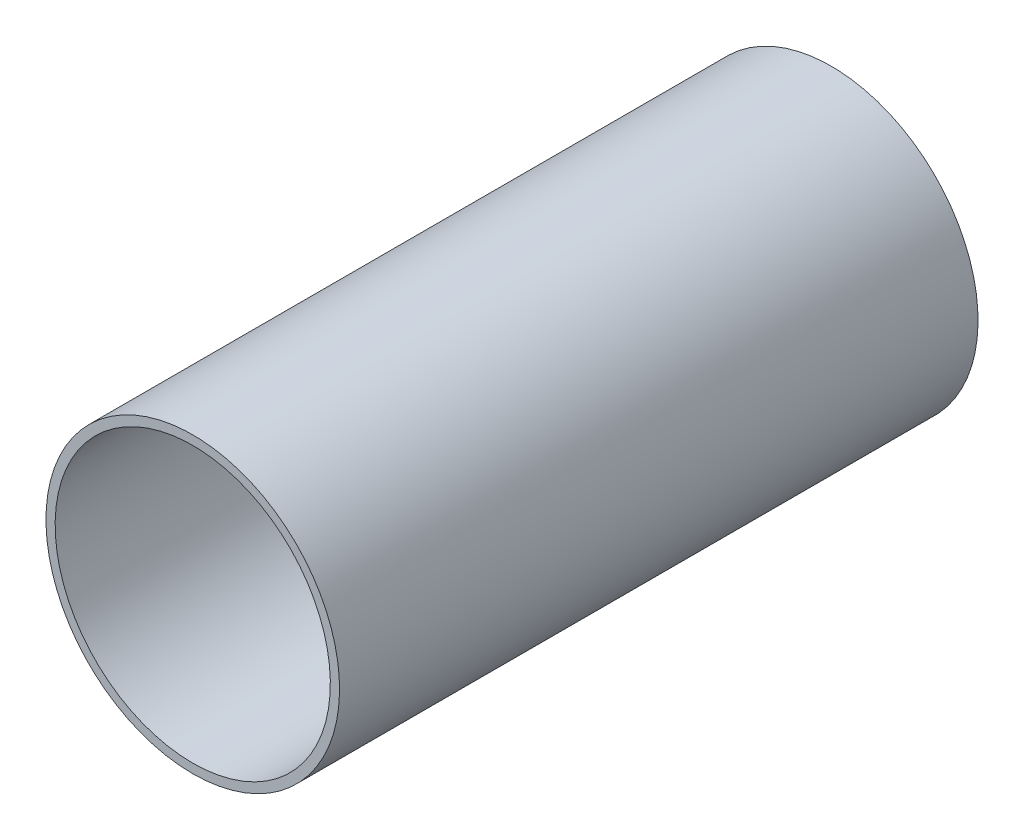
ISO-10303-21;
HEADER;
FILE_DESCRIPTION(('STEP AP214'),'2;1');
FILE_NAME('part.step','',(''),(''),'','','');
FILE_SCHEMA(('AUTOMOTIVE_DESIGN { 1 0 10303 214 1 1 1 1 }'));
ENDSEC;
DATA;
#1=APPLICATION_CONTEXT('core data for automotive mechanical design processes');
#2=APPLICATION_PROTOCOL_DEFINITION('international standard','automotive_design',2000,#1);
#3=PRODUCT_CONTEXT('',#1,'mechanical');
#4=PRODUCT('Part','Part','',(#3));
#5=PRODUCT_RELATED_PRODUCT_CATEGORY('part','',(#4));
#6=PRODUCT_DEFINITION_FORMATION('','',#4);
#7=PRODUCT_DEFINITION_CONTEXT('part definition',#1,'design');
#8=PRODUCT_DEFINITION('design','',#6,#7);
#9=PRODUCT_DEFINITION_SHAPE('','',#8);
#10=(LENGTH_UNIT() NAMED_UNIT(*) SI_UNIT(.MILLI.,.METRE.));
#11=(NAMED_UNIT(*) PLANE_ANGLE_UNIT() SI_UNIT($,.RADIAN.));
#12=(NAMED_UNIT(*) SI_UNIT($,.STERADIAN.) SOLID_ANGLE_UNIT());
#13=UNCERTAINTY_MEASURE_WITH_UNIT(LENGTH_MEASURE(1.E-05),#10,'distance_accuracy_value','');
#14=(GEOMETRIC_REPRESENTATION_CONTEXT(3) GLOBAL_UNCERTAINTY_ASSIGNED_CONTEXT((#13)) GLOBAL_UNIT_ASSIGNED_CONTEXT((#10,
#11,#12)) REPRESENTATION_CONTEXT('',''));
#15=CARTESIAN_POINT('',(0.,0.,0.));
#16=DIRECTION('',(0.,0.,1.));
#17=DIRECTION('',(1.,0.,0.));
#18=AXIS2_PLACEMENT_3D('',#15,#16,#17);
#19=CARTESIAN_POINT('',(176.276,-95.504,-0.045));
#20=DIRECTION('',(0.,0.,-1.));
#21=DIRECTION('',(0.,-1.,0.));
#22=AXIS2_PLACEMENT_3D('',#19,#20,#21);
#23=CYLINDRICAL_SURFACE('',#22,0.375);
#24=CARTESIAN_POINT('',(176.276,-95.504,-0.035));
#25=DIRECTION('',(0.,0.,-1.));
#26=DIRECTION('',(0.,-1.,0.));
#27=AXIS2_PLACEMENT_3D('',#24,#25,#26);
#28=CIRCLE('',#27,0.375);
#29=CARTESIAN_POINT('',(176.276,-95.879,-0.035));
#30=VERTEX_POINT('',#29);
#31=EDGE_CURVE('E64',#30,#30,#28,.T.);
#32=ORIENTED_EDGE('',*,*,#31,.T.);
#33=DIRECTION('',(0.,0.,1.));
#34=VECTOR('',#33,1.);
#35=CARTESIAN_POINT('',(176.276,-95.879,-0.045));
#36=LINE('',#35,#34);
#37=CARTESIAN_POINT('',(176.276,-95.879,1.705));
#38=VERTEX_POINT('',#37);
#39=EDGE_CURVE('E11',#30,#38,#36,.T.);
#40=ORIENTED_EDGE('',*,*,#39,.T.);
#41=CARTESIAN_POINT('',(176.276,-95.504,1.705));
#42=DIRECTION('',(0.,0.,-1.));
#43=DIRECTION('',(0.,-1.,0.));
#44=AXIS2_PLACEMENT_3D('',#41,#42,#43);
#45=CIRCLE('',#44,0.375);
#46=EDGE_CURVE('E25',#38,#38,#45,.T.);
#47=ORIENTED_EDGE('',*,*,#46,.F.);
#48=ORIENTED_EDGE('',*,*,#39,.F.);
#49=EDGE_LOOP('',(#32,#40,#47,#48));
#50=FACE_BOUND('',#49,.T.);
#51=ADVANCED_FACE('F17',(#50),#23,.F.);
#52=CARTESIAN_POINT('',(176.276,-95.904,1.705));
#53=DIRECTION('',(0.,0.,1.));
#54=DIRECTION('',(1.,0.,0.));
#55=AXIS2_PLACEMENT_3D('',#52,#53,#54);
#56=PLANE('',#55);
#57=ORIENTED_EDGE('',*,*,#46,.T.);
#58=EDGE_LOOP('',(#57));
#59=FACE_BOUND('',#58,.T.);
#60=CARTESIAN_POINT('',(176.276,-95.504,1.705));
#61=DIRECTION('',(0.,0.,1.));
#62=DIRECTION('',(0.,-1.,0.));
#63=AXIS2_PLACEMENT_3D('',#60,#61,#62);
#64=CIRCLE('',#63,0.4);
#65=CARTESIAN_POINT('',(176.276,-95.904,1.705));
#66=VERTEX_POINT('',#65);
#67=EDGE_CURVE('E56',#66,#66,#64,.T.);
#68=ORIENTED_EDGE('',*,*,#67,.T.);
#69=EDGE_LOOP('',(#68));
#70=FACE_BOUND('',#69,.T.);
#71=ADVANCED_FACE('F73',(#59,#70),#56,.T.);
#72=CARTESIAN_POINT('',(176.276,-95.904,-0.035));
#73=DIRECTION('',(0.,0.,1.));
#74=DIRECTION('',(1.,0.,0.));
#75=AXIS2_PLACEMENT_3D('',#72,#73,#74);
#76=PLANE('',#75);
#77=ORIENTED_EDGE('',*,*,#31,.F.);
#78=EDGE_LOOP('',(#77));
#79=FACE_BOUND('',#78,.T.);
#80=CARTESIAN_POINT('',(176.276,-95.504,-0.035));
#81=DIRECTION('',(0.,0.,1.));
#82=DIRECTION('',(0.,-1.,0.));
#83=AXIS2_PLACEMENT_3D('',#80,#81,#82);
#84=CIRCLE('',#83,0.4);
#85=CARTESIAN_POINT('',(176.276,-95.904,-0.035));
#86=VERTEX_POINT('',#85);
#87=EDGE_CURVE('E55',#86,#86,#84,.T.);
#88=ORIENTED_EDGE('',*,*,#87,.F.);
#89=EDGE_LOOP('',(#88));
#90=FACE_BOUND('',#89,.T.);
#91=ADVANCED_FACE('F82',(#79,#90),#76,.F.);
#92=CARTESIAN_POINT('',(176.276,-95.504,-0.035));
#93=DIRECTION('',(0.,0.,-1.));
#94=DIRECTION('',(0.,-1.,0.));
#95=AXIS2_PLACEMENT_3D('',#92,#93,#94);
#96=CYLINDRICAL_SURFACE('',#95,0.4);
#97=ORIENTED_EDGE('',*,*,#87,.T.);
#98=DIRECTION('',(0.,0.,1.));
#99=VECTOR('',#98,1.);
#100=CARTESIAN_POINT('',(176.276,-95.904,-0.035));
#101=LINE('',#100,#99);
#102=EDGE_CURVE('E52',#86,#66,#101,.T.);
#103=ORIENTED_EDGE('',*,*,#102,.T.);
#104=ORIENTED_EDGE('',*,*,#67,.F.);
#105=ORIENTED_EDGE('',*,*,#102,.F.);
#106=EDGE_LOOP('',(#97,#103,#104,#105));
#107=FACE_BOUND('',#106,.T.);
#108=ADVANCED_FACE('F53',(#107),#96,.T.);
#109=CLOSED_SHELL('',(#51,#71,#91,#108));
#110=MANIFOLD_SOLID_BREP('B1',#109);
#111=ADVANCED_BREP_SHAPE_REPRESENTATION('',(#18,#110),#14);
#112=SHAPE_DEFINITION_REPRESENTATION(#9,#111);
ENDSEC;
END-ISO-10303-21;
